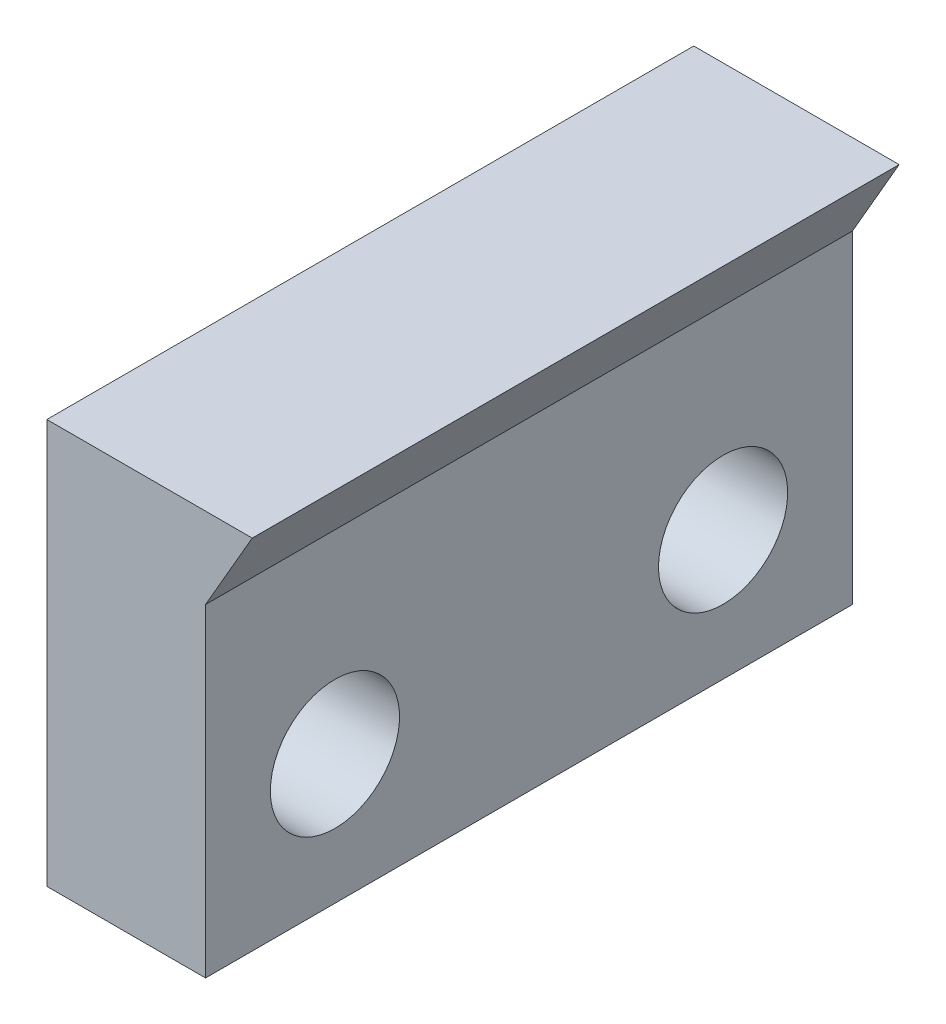
ISO-10303-21;
HEADER;
FILE_DESCRIPTION(('STEP AP214'),'2;1');
FILE_NAME('part.step','',(''),(''),'','','');
FILE_SCHEMA(('AUTOMOTIVE_DESIGN { 1 0 10303 214 1 1 1 1 }'));
ENDSEC;
DATA;
#1=APPLICATION_CONTEXT('core data for automotive mechanical design processes');
#2=APPLICATION_PROTOCOL_DEFINITION('international standard','automotive_design',2000,#1);
#3=PRODUCT_CONTEXT('',#1,'mechanical');
#4=PRODUCT('Part','Part','',(#3));
#5=PRODUCT_RELATED_PRODUCT_CATEGORY('part','',(#4));
#6=PRODUCT_DEFINITION_FORMATION('','',#4);
#7=PRODUCT_DEFINITION_CONTEXT('part definition',#1,'design');
#8=PRODUCT_DEFINITION('design','',#6,#7);
#9=PRODUCT_DEFINITION_SHAPE('','',#8);
#10=(LENGTH_UNIT() NAMED_UNIT(*) SI_UNIT(.MILLI.,.METRE.));
#11=(NAMED_UNIT(*) PLANE_ANGLE_UNIT() SI_UNIT($,.RADIAN.));
#12=(NAMED_UNIT(*) SI_UNIT($,.STERADIAN.) SOLID_ANGLE_UNIT());
#13=UNCERTAINTY_MEASURE_WITH_UNIT(LENGTH_MEASURE(1.E-05),#10,'distance_accuracy_value','');
#14=(GEOMETRIC_REPRESENTATION_CONTEXT(3) GLOBAL_UNCERTAINTY_ASSIGNED_CONTEXT((#13)) GLOBAL_UNIT_ASSIGNED_CONTEXT((#10,
#11,#12)) REPRESENTATION_CONTEXT('',''));
#15=CARTESIAN_POINT('',(0.,0.,0.));
#16=DIRECTION('',(0.,0.,1.));
#17=DIRECTION('',(1.,0.,0.));
#18=AXIS2_PLACEMENT_3D('',#15,#16,#17);
#19=CARTESIAN_POINT('',(0.,0.,20.));
#20=DIRECTION('',(-1.,0.,0.));
#21=DIRECTION('',(0.,0.,1.));
#22=AXIS2_PLACEMENT_3D('',#19,#20,#21);
#23=PLANE('',#22);
#24=CARTESIAN_POINT('',(0.,8.,12.));
#25=DIRECTION('',(-1.,0.,0.));
#26=DIRECTION('',(0.,0.,1.));
#27=AXIS2_PLACEMENT_3D('',#24,#25,#26);
#28=CIRCLE('',#27,3.99415);
#29=CARTESIAN_POINT('',(0.,8.,15.99415));
#30=VERTEX_POINT('',#29);
#31=EDGE_CURVE('E145',#30,#30,#28,.F.);
#32=ORIENTED_EDGE('',*,*,#31,.F.);
#33=EDGE_LOOP('',(#32));
#34=FACE_BOUND('',#33,.T.);
#35=CARTESIAN_POINT('',(0.,8.,-12.));
#36=DIRECTION('',(-1.,0.,0.));
#37=DIRECTION('',(0.,0.,1.));
#38=AXIS2_PLACEMENT_3D('',#35,#36,#37);
#39=CIRCLE('',#38,3.99415);
#40=CARTESIAN_POINT('',(0.,8.,-8.00585));
#41=VERTEX_POINT('',#40);
#42=EDGE_CURVE('E112',#41,#41,#39,.T.);
#43=ORIENTED_EDGE('',*,*,#42,.T.);
#44=EDGE_LOOP('',(#43));
#45=FACE_BOUND('',#44,.T.);
#46=DIRECTION('',(0.,1.,0.));
#47=VECTOR('',#46,1.);
#48=CARTESIAN_POINT('',(0.,0.,-20.));
#49=LINE('',#48,#47);
#50=CARTESIAN_POINT('',(0.,0.,-20.));
#51=VERTEX_POINT('',#50);
#52=CARTESIAN_POINT('',(0.,20.,-20.));
#53=VERTEX_POINT('',#52);
#54=EDGE_CURVE('E108',#51,#53,#49,.T.);
#55=ORIENTED_EDGE('',*,*,#54,.T.);
#56=DIRECTION('',(0.,0.,-1.));
#57=VECTOR('',#56,1.);
#58=CARTESIAN_POINT('',(0.,20.,20.));
#59=LINE('',#58,#57);
#60=CARTESIAN_POINT('',(0.,20.,20.));
#61=VERTEX_POINT('',#60);
#62=EDGE_CURVE('E11',#61,#53,#59,.T.);
#63=ORIENTED_EDGE('',*,*,#62,.F.);
#64=DIRECTION('',(0.,1.,0.));
#65=VECTOR('',#64,1.);
#66=CARTESIAN_POINT('',(0.,0.,20.));
#67=LINE('',#66,#65);
#68=CARTESIAN_POINT('',(0.,0.,20.));
#69=VERTEX_POINT('',#68);
#70=EDGE_CURVE('E117',#69,#61,#67,.T.);
#71=ORIENTED_EDGE('',*,*,#70,.F.);
#72=DIRECTION('',(0.,0.,-1.));
#73=VECTOR('',#72,1.);
#74=CARTESIAN_POINT('',(0.,0.,20.));
#75=LINE('',#74,#73);
#76=EDGE_CURVE('E104',#69,#51,#75,.T.);
#77=ORIENTED_EDGE('',*,*,#76,.T.);
#78=EDGE_LOOP('',(#55,#63,#71,#77));
#79=FACE_BOUND('',#78,.T.);
#80=ADVANCED_FACE('F34',(#34,#45,#79),#23,.F.);
#81=CARTESIAN_POINT('',(2.88675134594809,25.,20.));
#82=DIRECTION('',(-0.866025403784442,0.499999999999995,0.));
#83=DIRECTION('',(-0.499999999999995,-0.866025403784442,0.));
#84=AXIS2_PLACEMENT_3D('',#81,#82,#83);
#85=PLANE('',#84);
#86=DIRECTION('',(0.499999999999995,0.866025403784442,0.));
#87=VECTOR('',#86,1.);
#88=CARTESIAN_POINT('',(2.88675134594809,25.,-20.));
#89=LINE('',#88,#87);
#90=CARTESIAN_POINT('',(2.88675134594809,25.,-20.));
#91=VERTEX_POINT('',#90);
#92=EDGE_CURVE('E111',#53,#91,#89,.T.);
#93=ORIENTED_EDGE('',*,*,#92,.T.);
#94=DIRECTION('',(0.,0.,-1.));
#95=VECTOR('',#94,1.);
#96=CARTESIAN_POINT('',(2.88675134594809,25.,20.));
#97=LINE('',#96,#95);
#98=CARTESIAN_POINT('',(2.88675134594809,25.,20.));
#99=VERTEX_POINT('',#98);
#100=EDGE_CURVE('E42',#99,#91,#97,.T.);
#101=ORIENTED_EDGE('',*,*,#100,.F.);
#102=DIRECTION('',(0.499999999999995,0.866025403784442,0.));
#103=VECTOR('',#102,1.);
#104=CARTESIAN_POINT('',(2.88675134594809,25.,20.));
#105=LINE('',#104,#103);
#106=EDGE_CURVE('E84',#61,#99,#105,.T.);
#107=ORIENTED_EDGE('',*,*,#106,.F.);
#108=ORIENTED_EDGE('',*,*,#62,.T.);
#109=EDGE_LOOP('',(#93,#101,#107,#108));
#110=FACE_BOUND('',#109,.T.);
#111=ADVANCED_FACE('F137',(#110),#85,.F.);
#112=CARTESIAN_POINT('',(-9.81324865405191,25.,20.));
#113=DIRECTION('',(0.,-1.,0.));
#114=DIRECTION('',(1.,0.,0.));
#115=AXIS2_PLACEMENT_3D('',#112,#113,#114);
#116=PLANE('',#115);
#117=DIRECTION('',(-1.,0.,0.));
#118=VECTOR('',#117,1.);
#119=CARTESIAN_POINT('',(-9.81324865405191,25.,-20.));
#120=LINE('',#119,#118);
#121=CARTESIAN_POINT('',(-9.81324865405191,25.,-20.));
#122=VERTEX_POINT('',#121);
#123=EDGE_CURVE('E99',#91,#122,#120,.T.);
#124=ORIENTED_EDGE('',*,*,#123,.T.);
#125=DIRECTION('',(0.,0.,-1.));
#126=VECTOR('',#125,1.);
#127=CARTESIAN_POINT('',(-9.81324865405191,25.,20.));
#128=LINE('',#127,#126);
#129=CARTESIAN_POINT('',(-9.81324865405191,25.,20.));
#130=VERTEX_POINT('',#129);
#131=EDGE_CURVE('E96',#130,#122,#128,.T.);
#132=ORIENTED_EDGE('',*,*,#131,.F.);
#133=DIRECTION('',(-1.,0.,0.));
#134=VECTOR('',#133,1.);
#135=CARTESIAN_POINT('',(-9.81324865405191,25.,20.));
#136=LINE('',#135,#134);
#137=EDGE_CURVE('E88',#99,#130,#136,.T.);
#138=ORIENTED_EDGE('',*,*,#137,.F.);
#139=ORIENTED_EDGE('',*,*,#100,.T.);
#140=EDGE_LOOP('',(#124,#132,#138,#139));
#141=FACE_BOUND('',#140,.T.);
#142=ADVANCED_FACE('F97',(#141),#116,.F.);
#143=CARTESIAN_POINT('',(-9.81324865405191,0.,20.));
#144=DIRECTION('',(1.,0.,0.));
#145=DIRECTION('',(0.,0.,-1.));
#146=AXIS2_PLACEMENT_3D('',#143,#144,#145);
#147=PLANE('',#146);
#148=CARTESIAN_POINT('',(-9.81324865405191,8.,12.));
#149=DIRECTION('',(1.,0.,0.));
#150=DIRECTION('',(0.,0.,-1.));
#151=AXIS2_PLACEMENT_3D('',#148,#149,#150);
#152=CIRCLE('',#151,3.99415);
#153=CARTESIAN_POINT('',(-9.81324865405191,8.,8.00585));
#154=VERTEX_POINT('',#153);
#155=EDGE_CURVE('E156',#154,#154,#152,.T.);
#156=ORIENTED_EDGE('',*,*,#155,.T.);
#157=EDGE_LOOP('',(#156));
#158=FACE_BOUND('',#157,.T.);
#159=CARTESIAN_POINT('',(-9.81324865405191,8.,-12.));
#160=DIRECTION('',(-1.,0.,0.));
#161=DIRECTION('',(0.,0.,1.));
#162=AXIS2_PLACEMENT_3D('',#159,#160,#161);
#163=CIRCLE('',#162,3.99415);
#164=CARTESIAN_POINT('',(-9.81324865405191,8.,-8.00585));
#165=VERTEX_POINT('',#164);
#166=EDGE_CURVE('E149',#165,#165,#163,.T.);
#167=ORIENTED_EDGE('',*,*,#166,.F.);
#168=EDGE_LOOP('',(#167));
#169=FACE_BOUND('',#168,.T.);
#170=DIRECTION('',(0.,-1.,0.));
#171=VECTOR('',#170,1.);
#172=CARTESIAN_POINT('',(-9.81324865405191,0.,-20.));
#173=LINE('',#172,#171);
#174=CARTESIAN_POINT('',(-9.81324865405191,0.,-20.));
#175=VERTEX_POINT('',#174);
#176=EDGE_CURVE('E70',#122,#175,#173,.T.);
#177=ORIENTED_EDGE('',*,*,#176,.T.);
#178=DIRECTION('',(0.,0.,-1.));
#179=VECTOR('',#178,1.);
#180=CARTESIAN_POINT('',(-9.81324865405191,0.,20.));
#181=LINE('',#180,#179);
#182=CARTESIAN_POINT('',(-9.81324865405191,0.,20.));
#183=VERTEX_POINT('',#182);
#184=EDGE_CURVE('E100',#183,#175,#181,.T.);
#185=ORIENTED_EDGE('',*,*,#184,.F.);
#186=DIRECTION('',(0.,-1.,0.));
#187=VECTOR('',#186,1.);
#188=CARTESIAN_POINT('',(-9.81324865405191,0.,20.));
#189=LINE('',#188,#187);
#190=EDGE_CURVE('E92',#130,#183,#189,.T.);
#191=ORIENTED_EDGE('',*,*,#190,.F.);
#192=ORIENTED_EDGE('',*,*,#131,.T.);
#193=EDGE_LOOP('',(#177,#185,#191,#192));
#194=FACE_BOUND('',#193,.T.);
#195=ADVANCED_FACE('F102',(#158,#169,#194),#147,.F.);
#196=CARTESIAN_POINT('',(0.,0.,20.));
#197=DIRECTION('',(0.,1.,0.));
#198=DIRECTION('',(-1.,0.,0.));
#199=AXIS2_PLACEMENT_3D('',#196,#197,#198);
#200=PLANE('',#199);
#201=DIRECTION('',(1.,0.,0.));
#202=VECTOR('',#201,1.);
#203=CARTESIAN_POINT('',(0.,0.,-20.));
#204=LINE('',#203,#202);
#205=EDGE_CURVE('E76',#175,#51,#204,.T.);
#206=ORIENTED_EDGE('',*,*,#205,.T.);
#207=ORIENTED_EDGE('',*,*,#76,.F.);
#208=DIRECTION('',(1.,0.,0.));
#209=VECTOR('',#208,1.);
#210=CARTESIAN_POINT('',(0.,0.,20.));
#211=LINE('',#210,#209);
#212=EDGE_CURVE('E50',#183,#69,#211,.T.);
#213=ORIENTED_EDGE('',*,*,#212,.F.);
#214=ORIENTED_EDGE('',*,*,#184,.T.);
#215=EDGE_LOOP('',(#206,#207,#213,#214));
#216=FACE_BOUND('',#215,.T.);
#217=ADVANCED_FACE('F125',(#216),#200,.F.);
#218=CARTESIAN_POINT('',(0.,0.,20.));
#219=DIRECTION('',(0.,0.,-1.));
#220=DIRECTION('',(-1.,0.,0.));
#221=AXIS2_PLACEMENT_3D('',#218,#219,#220);
#222=PLANE('',#221);
#223=ORIENTED_EDGE('',*,*,#70,.T.);
#224=ORIENTED_EDGE('',*,*,#106,.T.);
#225=ORIENTED_EDGE('',*,*,#137,.T.);
#226=ORIENTED_EDGE('',*,*,#190,.T.);
#227=ORIENTED_EDGE('',*,*,#212,.T.);
#228=EDGE_LOOP('',(#223,#224,#225,#226,#227));
#229=FACE_BOUND('',#228,.T.);
#230=ADVANCED_FACE('F90',(#229),#222,.F.);
#231=CARTESIAN_POINT('',(0.,0.,-20.));
#232=DIRECTION('',(0.,0.,-1.));
#233=DIRECTION('',(-1.,0.,0.));
#234=AXIS2_PLACEMENT_3D('',#231,#232,#233);
#235=PLANE('',#234);
#236=ORIENTED_EDGE('',*,*,#54,.F.);
#237=ORIENTED_EDGE('',*,*,#205,.F.);
#238=ORIENTED_EDGE('',*,*,#176,.F.);
#239=ORIENTED_EDGE('',*,*,#123,.F.);
#240=ORIENTED_EDGE('',*,*,#92,.F.);
#241=EDGE_LOOP('',(#236,#237,#238,#239,#240));
#242=FACE_BOUND('',#241,.T.);
#243=ADVANCED_FACE('F121',(#242),#235,.T.);
#244=CARTESIAN_POINT('',(2.88675134594809,8.,-12.));
#245=DIRECTION('',(-1.,0.,0.));
#246=DIRECTION('',(0.,0.,1.));
#247=AXIS2_PLACEMENT_3D('',#244,#245,#246);
#248=CYLINDRICAL_SURFACE('',#247,3.99415);
#249=ORIENTED_EDGE('',*,*,#166,.T.);
#250=EDGE_LOOP('',(#249));
#251=FACE_BOUND('',#250,.T.);
#252=ORIENTED_EDGE('',*,*,#42,.F.);
#253=EDGE_LOOP('',(#252));
#254=FACE_BOUND('',#253,.T.);
#255=ADVANCED_FACE('F164',(#251,#254),#248,.F.);
#256=CARTESIAN_POINT('',(2.88675134594809,8.,12.));
#257=DIRECTION('',(-1.,0.,0.));
#258=DIRECTION('',(0.,0.,1.));
#259=AXIS2_PLACEMENT_3D('',#256,#257,#258);
#260=CYLINDRICAL_SURFACE('',#259,3.99415);
#261=ORIENTED_EDGE('',*,*,#155,.F.);
#262=EDGE_LOOP('',(#261));
#263=FACE_BOUND('',#262,.T.);
#264=ORIENTED_EDGE('',*,*,#31,.T.);
#265=EDGE_LOOP('',(#264));
#266=FACE_BOUND('',#265,.T.);
#267=ADVANCED_FACE('F161',(#263,#266),#260,.F.);
#268=CLOSED_SHELL('',(#80,#111,#142,#195,#217,#230,#243,#255,#267));
#269=MANIFOLD_SOLID_BREP('B2',#268);
#270=ADVANCED_BREP_SHAPE_REPRESENTATION('',(#18,#269),#14);
#271=SHAPE_DEFINITION_REPRESENTATION(#9,#270);
ENDSEC;
END-ISO-10303-21;
